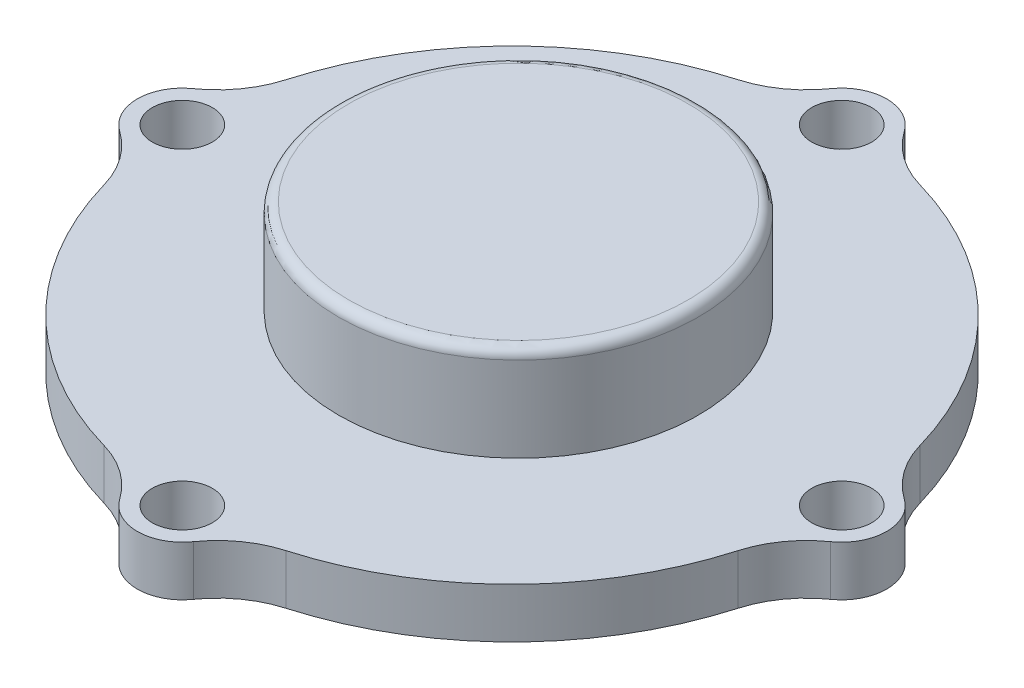
ISO-10303-21;
HEADER;
FILE_DESCRIPTION(('STEP AP214'),'2;1');
FILE_NAME('part.step','',(''),(''),'','','');
FILE_SCHEMA(('AUTOMOTIVE_DESIGN { 1 0 10303 214 1 1 1 1 }'));
ENDSEC;
DATA;
#1=APPLICATION_CONTEXT('core data for automotive mechanical design processes');
#2=APPLICATION_PROTOCOL_DEFINITION('international standard','automotive_design',2000,#1);
#3=PRODUCT_CONTEXT('',#1,'mechanical');
#4=PRODUCT('Part','Part','',(#3));
#5=PRODUCT_RELATED_PRODUCT_CATEGORY('part','',(#4));
#6=PRODUCT_DEFINITION_FORMATION('','',#4);
#7=PRODUCT_DEFINITION_CONTEXT('part definition',#1,'design');
#8=PRODUCT_DEFINITION('design','',#6,#7);
#9=PRODUCT_DEFINITION_SHAPE('','',#8);
#10=(LENGTH_UNIT() NAMED_UNIT(*) SI_UNIT(.MILLI.,.METRE.));
#11=(NAMED_UNIT(*) PLANE_ANGLE_UNIT() SI_UNIT($,.RADIAN.));
#12=(NAMED_UNIT(*) SI_UNIT($,.STERADIAN.) SOLID_ANGLE_UNIT());
#13=UNCERTAINTY_MEASURE_WITH_UNIT(LENGTH_MEASURE(1.E-05),#10,'distance_accuracy_value','');
#14=(GEOMETRIC_REPRESENTATION_CONTEXT(3) GLOBAL_UNCERTAINTY_ASSIGNED_CONTEXT((#13)) GLOBAL_UNIT_ASSIGNED_CONTEXT((#10,
#11,#12)) REPRESENTATION_CONTEXT('',''));
#15=CARTESIAN_POINT('',(0.,0.,0.));
#16=DIRECTION('',(0.,0.,1.));
#17=DIRECTION('',(1.,0.,0.));
#18=AXIS2_PLACEMENT_3D('',#15,#16,#17);
#19=CARTESIAN_POINT('',(0.,5.,0.));
#20=DIRECTION('',(0.,1.,0.));
#21=DIRECTION('',(0.,0.,1.));
#22=AXIS2_PLACEMENT_3D('',#19,#20,#21);
#23=PLANE('',#22);
#24=CARTESIAN_POINT('',(0.,5.,-0.64740108925233));
#25=DIRECTION('',(0.,1.,0.));
#26=DIRECTION('',(0.,0.,1.));
#27=AXIS2_PLACEMENT_3D('',#24,#25,#26);
#28=CIRCLE('',#27,18.);
#29=CARTESIAN_POINT('',(0.,5.,17.3525989107477));
#30=VERTEX_POINT('',#29);
#31=EDGE_CURVE('E242',#30,#30,#28,.T.);
#32=ORIENTED_EDGE('',*,*,#31,.F.);
#33=EDGE_LOOP('',(#32));
#34=FACE_BOUND('',#33,.T.);
#35=CARTESIAN_POINT('',(0.00100000000000606,5.,33.001));
#36=DIRECTION('',(0.,1.,0.));
#37=DIRECTION('',(0.,0.,1.));
#38=AXIS2_PLACEMENT_3D('',#35,#36,#37);
#39=CIRCLE('',#38,3.);
#40=CARTESIAN_POINT('',(0.00100000000000606,5.,36.001));
#41=VERTEX_POINT('',#40);
#42=EDGE_CURVE('E201',#41,#41,#39,.T.);
#43=ORIENTED_EDGE('',*,*,#42,.F.);
#44=EDGE_LOOP('',(#43));
#45=FACE_BOUND('',#44,.T.);
#46=CARTESIAN_POINT('',(33.002,5.,0.));
#47=DIRECTION('',(0.,1.,0.));
#48=DIRECTION('',(0.,0.,1.));
#49=AXIS2_PLACEMENT_3D('',#46,#47,#48);
#50=CIRCLE('',#49,3.);
#51=CARTESIAN_POINT('',(33.002,5.,3.));
#52=VERTEX_POINT('',#51);
#53=EDGE_CURVE('E184',#52,#52,#50,.T.);
#54=ORIENTED_EDGE('',*,*,#53,.F.);
#55=EDGE_LOOP('',(#54));
#56=FACE_BOUND('',#55,.T.);
#57=CARTESIAN_POINT('',(0.000999999999997979,5.,-33.001));
#58=DIRECTION('',(0.,1.,0.));
#59=DIRECTION('',(0.,0.,1.));
#60=AXIS2_PLACEMENT_3D('',#57,#58,#59);
#61=CIRCLE('',#60,3.);
#62=CARTESIAN_POINT('',(0.000999999999997979,5.,-30.001));
#63=VERTEX_POINT('',#62);
#64=EDGE_CURVE('E212',#63,#63,#61,.T.);
#65=ORIENTED_EDGE('',*,*,#64,.F.);
#66=EDGE_LOOP('',(#65));
#67=FACE_BOUND('',#66,.T.);
#68=CARTESIAN_POINT('',(-33.,5.,0.));
#69=DIRECTION('',(0.,1.,0.));
#70=DIRECTION('',(0.,0.,1.));
#71=AXIS2_PLACEMENT_3D('',#68,#69,#70);
#72=CIRCLE('',#71,3.);
#73=CARTESIAN_POINT('',(-33.,5.,3.));
#74=VERTEX_POINT('',#73);
#75=EDGE_CURVE('E194',#74,#74,#72,.T.);
#76=ORIENTED_EDGE('',*,*,#75,.F.);
#77=EDGE_LOOP('',(#76));
#78=FACE_BOUND('',#77,.T.);
#79=CARTESIAN_POINT('',(0.,5.,0.));
#80=DIRECTION('',(0.,-1.,0.));
#81=DIRECTION('',(0.,0.,-1.));
#82=AXIS2_PLACEMENT_3D('',#79,#80,#81);
#83=CIRCLE('',#82,33.);
#84=CARTESIAN_POINT('',(-9.10862232961965,5.,31.718023255814));
#85=VERTEX_POINT('',#84);
#86=CARTESIAN_POINT('',(-31.7180232558139,5.,9.10862232961966));
#87=VERTEX_POINT('',#86);
#88=EDGE_CURVE('E255',#85,#87,#83,.T.);
#89=ORIENTED_EDGE('',*,*,#88,.F.);
#90=CARTESIAN_POINT('',(-11.8688109143529,5.,41.3295454545454));
#91=DIRECTION('',(0.,1.,0.));
#92=DIRECTION('',(0.,0.,1.));
#93=AXIS2_PLACEMENT_3D('',#90,#91,#92);
#94=CIRCLE('',#93,10.);
#95=CARTESIAN_POINT('',(-3.68342407686815,5.,35.5850313479624));
#96=VERTEX_POINT('',#95);
#97=EDGE_CURVE('E50',#96,#85,#94,.T.);
#98=ORIENTED_EDGE('',*,*,#97,.F.);
#99=CARTESIAN_POINT('',(0.,5.,33.));
#100=DIRECTION('',(0.,-1.,0.));
#101=DIRECTION('',(0.,0.,-1.));
#102=AXIS2_PLACEMENT_3D('',#99,#100,#101);
#103=CIRCLE('',#102,4.50000000000003);
#104=CARTESIAN_POINT('',(3.68342407686815,5.,35.5850313479624));
#105=VERTEX_POINT('',#104);
#106=EDGE_CURVE('E295',#105,#96,#103,.T.);
#107=ORIENTED_EDGE('',*,*,#106,.F.);
#108=CARTESIAN_POINT('',(11.8688109143529,5.,41.3295454545454));
#109=DIRECTION('',(0.,1.,0.));
#110=DIRECTION('',(0.,0.,-1.));
#111=AXIS2_PLACEMENT_3D('',#108,#109,#110);
#112=CIRCLE('',#111,10.);
#113=CARTESIAN_POINT('',(9.10862232961966,5.,31.7180232558139));
#114=VERTEX_POINT('',#113);
#115=EDGE_CURVE('E292',#114,#105,#112,.T.);
#116=ORIENTED_EDGE('',*,*,#115,.F.);
#117=CARTESIAN_POINT('',(0.,5.,0.));
#118=DIRECTION('',(0.,-1.,0.));
#119=DIRECTION('',(0.,0.,-1.));
#120=AXIS2_PLACEMENT_3D('',#117,#118,#119);
#121=CIRCLE('',#120,33.);
#122=CARTESIAN_POINT('',(31.718023255814,5.,9.1086223296196));
#123=VERTEX_POINT('',#122);
#124=EDGE_CURVE('E289',#123,#114,#121,.T.);
#125=ORIENTED_EDGE('',*,*,#124,.F.);
#126=CARTESIAN_POINT('',(41.3295454545455,5.,11.8688109143528));
#127=DIRECTION('',(0.,1.,0.));
#128=DIRECTION('',(0.,0.,1.));
#129=AXIS2_PLACEMENT_3D('',#126,#127,#128);
#130=CIRCLE('',#129,10.);
#131=CARTESIAN_POINT('',(35.5850313479624,5.,3.6834240768681));
#132=VERTEX_POINT('',#131);
#133=EDGE_CURVE('E286',#132,#123,#130,.T.);
#134=ORIENTED_EDGE('',*,*,#133,.F.);
#135=CARTESIAN_POINT('',(33.,5.,0.));
#136=DIRECTION('',(0.,-1.,0.));
#137=DIRECTION('',(0.,0.,-1.));
#138=AXIS2_PLACEMENT_3D('',#135,#136,#137);
#139=CIRCLE('',#138,4.49999999999998);
#140=CARTESIAN_POINT('',(35.5850313479624,5.,-3.6834240768681));
#141=VERTEX_POINT('',#140);
#142=EDGE_CURVE('E284',#141,#132,#139,.T.);
#143=ORIENTED_EDGE('',*,*,#142,.F.);
#144=CARTESIAN_POINT('',(41.3295454545455,5.,-11.8688109143528));
#145=DIRECTION('',(0.,1.,0.));
#146=DIRECTION('',(0.,0.,-1.));
#147=AXIS2_PLACEMENT_3D('',#144,#145,#146);
#148=CIRCLE('',#147,10.);
#149=CARTESIAN_POINT('',(31.718023255814,5.,-9.1086223296196));
#150=VERTEX_POINT('',#149);
#151=EDGE_CURVE('E281',#150,#141,#148,.T.);
#152=ORIENTED_EDGE('',*,*,#151,.F.);
#153=CARTESIAN_POINT('',(0.,5.,0.));
#154=DIRECTION('',(0.,-1.,0.));
#155=DIRECTION('',(0.,0.,-1.));
#156=AXIS2_PLACEMENT_3D('',#153,#154,#155);
#157=CIRCLE('',#156,33.);
#158=CARTESIAN_POINT('',(9.1086223296196,5.,-31.718023255814));
#159=VERTEX_POINT('',#158);
#160=EDGE_CURVE('E278',#159,#150,#157,.T.);
#161=ORIENTED_EDGE('',*,*,#160,.F.);
#162=CARTESIAN_POINT('',(11.8688109143528,5.,-41.3295454545455));
#163=DIRECTION('',(0.,1.,0.));
#164=DIRECTION('',(0.,0.,1.));
#165=AXIS2_PLACEMENT_3D('',#162,#163,#164);
#166=CIRCLE('',#165,10.);
#167=CARTESIAN_POINT('',(3.6834240768681,5.,-35.5850313479624));
#168=VERTEX_POINT('',#167);
#169=EDGE_CURVE('E275',#168,#159,#166,.T.);
#170=ORIENTED_EDGE('',*,*,#169,.F.);
#171=CARTESIAN_POINT('',(0.,5.,-33.));
#172=DIRECTION('',(0.,-1.,0.));
#173=DIRECTION('',(0.,0.,-1.));
#174=AXIS2_PLACEMENT_3D('',#171,#172,#173);
#175=CIRCLE('',#174,4.49999999999998);
#176=CARTESIAN_POINT('',(-3.6834240768681,5.,-35.5850313479624));
#177=VERTEX_POINT('',#176);
#178=EDGE_CURVE('E273',#177,#168,#175,.T.);
#179=ORIENTED_EDGE('',*,*,#178,.F.);
#180=CARTESIAN_POINT('',(-11.8688109143528,5.,-41.3295454545455));
#181=DIRECTION('',(0.,1.,0.));
#182=DIRECTION('',(0.,0.,-1.));
#183=AXIS2_PLACEMENT_3D('',#180,#181,#182);
#184=CIRCLE('',#183,10.);
#185=CARTESIAN_POINT('',(-9.1086223296196,5.,-31.718023255814));
#186=VERTEX_POINT('',#185);
#187=EDGE_CURVE('E270',#186,#177,#184,.T.);
#188=ORIENTED_EDGE('',*,*,#187,.F.);
#189=CARTESIAN_POINT('',(0.,5.,0.));
#190=DIRECTION('',(0.,-1.,0.));
#191=DIRECTION('',(0.,0.,-1.));
#192=AXIS2_PLACEMENT_3D('',#189,#190,#191);
#193=CIRCLE('',#192,33.);
#194=CARTESIAN_POINT('',(-31.718023255814,5.,-9.10862232961965));
#195=VERTEX_POINT('',#194);
#196=EDGE_CURVE('E267',#195,#186,#193,.T.);
#197=ORIENTED_EDGE('',*,*,#196,.F.);
#198=CARTESIAN_POINT('',(-41.3295454545454,5.,-11.8688109143529));
#199=DIRECTION('',(0.,1.,0.));
#200=DIRECTION('',(0.,0.,1.));
#201=AXIS2_PLACEMENT_3D('',#198,#199,#200);
#202=CIRCLE('',#201,10.);
#203=CARTESIAN_POINT('',(-35.5850313479624,5.,-3.68342407686815));
#204=VERTEX_POINT('',#203);
#205=EDGE_CURVE('E264',#204,#195,#202,.T.);
#206=ORIENTED_EDGE('',*,*,#205,.F.);
#207=CARTESIAN_POINT('',(-33.,5.,0.));
#208=DIRECTION('',(0.,-1.,0.));
#209=DIRECTION('',(0.,0.,-1.));
#210=AXIS2_PLACEMENT_3D('',#207,#208,#209);
#211=CIRCLE('',#210,4.50000000000003);
#212=CARTESIAN_POINT('',(-35.5850313479624,5.,3.68342407686816));
#213=VERTEX_POINT('',#212);
#214=EDGE_CURVE('E262',#213,#204,#211,.T.);
#215=ORIENTED_EDGE('',*,*,#214,.F.);
#216=CARTESIAN_POINT('',(-41.3295454545454,5.,11.8688109143529));
#217=DIRECTION('',(0.,1.,0.));
#218=DIRECTION('',(0.,0.,-1.));
#219=AXIS2_PLACEMENT_3D('',#216,#217,#218);
#220=CIRCLE('',#219,10.);
#221=EDGE_CURVE('E259',#87,#213,#220,.T.);
#222=ORIENTED_EDGE('',*,*,#221,.F.);
#223=EDGE_LOOP('',(#89,#98,#107,#116,#125,#134,#143,#152,#161,#170,#179,#188,#197,#206,#215,#222));
#224=FACE_BOUND('',#223,.T.);
#225=ADVANCED_FACE('F35',(#34,#45,#56,#67,#78,#224),#23,.T.);
#226=CARTESIAN_POINT('',(0.,0.,0.));
#227=DIRECTION('',(0.,1.,0.));
#228=DIRECTION('',(0.,0.,1.));
#229=AXIS2_PLACEMENT_3D('',#226,#227,#228);
#230=PLANE('',#229);
#231=CARTESIAN_POINT('',(0.,0.,0.));
#232=DIRECTION('',(0.,-1.,0.));
#233=DIRECTION('',(0.,0.,-1.));
#234=AXIS2_PLACEMENT_3D('',#231,#232,#233);
#235=CIRCLE('',#234,27.75);
#236=CARTESIAN_POINT('',(0.,0.,-27.75));
#237=VERTEX_POINT('',#236);
#238=EDGE_CURVE('E334',#237,#237,#235,.T.);
#239=ORIENTED_EDGE('',*,*,#238,.F.);
#240=EDGE_LOOP('',(#239));
#241=FACE_BOUND('',#240,.T.);
#242=CARTESIAN_POINT('',(0.00100000000000606,0.,33.001));
#243=DIRECTION('',(0.,1.,0.));
#244=DIRECTION('',(0.,0.,1.));
#245=AXIS2_PLACEMENT_3D('',#242,#243,#244);
#246=CIRCLE('',#245,3.);
#247=CARTESIAN_POINT('',(0.00100000000000606,0.,36.001));
#248=VERTEX_POINT('',#247);
#249=EDGE_CURVE('E217',#248,#248,#246,.T.);
#250=ORIENTED_EDGE('',*,*,#249,.T.);
#251=EDGE_LOOP('',(#250));
#252=FACE_BOUND('',#251,.T.);
#253=CARTESIAN_POINT('',(33.002,0.,0.));
#254=DIRECTION('',(0.,1.,0.));
#255=DIRECTION('',(0.,0.,1.));
#256=AXIS2_PLACEMENT_3D('',#253,#254,#255);
#257=CIRCLE('',#256,3.);
#258=CARTESIAN_POINT('',(33.002,0.,3.));
#259=VERTEX_POINT('',#258);
#260=EDGE_CURVE('E220',#259,#259,#257,.T.);
#261=ORIENTED_EDGE('',*,*,#260,.T.);
#262=EDGE_LOOP('',(#261));
#263=FACE_BOUND('',#262,.T.);
#264=CARTESIAN_POINT('',(0.000999999999997979,0.,-33.001));
#265=DIRECTION('',(0.,1.,0.));
#266=DIRECTION('',(0.,0.,1.));
#267=AXIS2_PLACEMENT_3D('',#264,#265,#266);
#268=CIRCLE('',#267,3.);
#269=CARTESIAN_POINT('',(0.000999999999997979,0.,-30.001));
#270=VERTEX_POINT('',#269);
#271=EDGE_CURVE('E224',#270,#270,#268,.T.);
#272=ORIENTED_EDGE('',*,*,#271,.T.);
#273=EDGE_LOOP('',(#272));
#274=FACE_BOUND('',#273,.T.);
#275=CARTESIAN_POINT('',(-33.,0.,0.));
#276=DIRECTION('',(0.,1.,0.));
#277=DIRECTION('',(0.,0.,1.));
#278=AXIS2_PLACEMENT_3D('',#275,#276,#277);
#279=CIRCLE('',#278,3.);
#280=CARTESIAN_POINT('',(-33.,0.,3.));
#281=VERTEX_POINT('',#280);
#282=EDGE_CURVE('E205',#281,#281,#279,.T.);
#283=ORIENTED_EDGE('',*,*,#282,.T.);
#284=EDGE_LOOP('',(#283));
#285=FACE_BOUND('',#284,.T.);
#286=CARTESIAN_POINT('',(-11.8688109143529,0.,41.3295454545454));
#287=DIRECTION('',(0.,1.,0.));
#288=DIRECTION('',(0.,0.,1.));
#289=AXIS2_PLACEMENT_3D('',#286,#287,#288);
#290=CIRCLE('',#289,10.);
#291=CARTESIAN_POINT('',(-3.68342407686815,0.,35.5850313479624));
#292=VERTEX_POINT('',#291);
#293=CARTESIAN_POINT('',(-9.10862232961965,0.,31.718023255814));
#294=VERTEX_POINT('',#293);
#295=EDGE_CURVE('E298',#292,#294,#290,.T.);
#296=ORIENTED_EDGE('',*,*,#295,.T.);
#297=CARTESIAN_POINT('',(0.,0.,0.));
#298=DIRECTION('',(0.,-1.,0.));
#299=DIRECTION('',(0.,0.,-1.));
#300=AXIS2_PLACEMENT_3D('',#297,#298,#299);
#301=CIRCLE('',#300,33.);
#302=CARTESIAN_POINT('',(-31.7180232558139,0.,9.10862232961966));
#303=VERTEX_POINT('',#302);
#304=EDGE_CURVE('E301',#294,#303,#301,.T.);
#305=ORIENTED_EDGE('',*,*,#304,.T.);
#306=CARTESIAN_POINT('',(-41.3295454545454,0.,11.8688109143529));
#307=DIRECTION('',(0.,1.,0.));
#308=DIRECTION('',(0.,0.,-1.));
#309=AXIS2_PLACEMENT_3D('',#306,#307,#308);
#310=CIRCLE('',#309,10.);
#311=CARTESIAN_POINT('',(-35.5850313479624,0.,3.68342407686816));
#312=VERTEX_POINT('',#311);
#313=EDGE_CURVE('E58',#303,#312,#310,.T.);
#314=ORIENTED_EDGE('',*,*,#313,.T.);
#315=CARTESIAN_POINT('',(-33.,0.,0.));
#316=DIRECTION('',(0.,1.,0.));
#317=DIRECTION('',(0.,0.,1.));
#318=AXIS2_PLACEMENT_3D('',#315,#316,#317);
#319=CIRCLE('',#318,4.50000000000003);
#320=CARTESIAN_POINT('',(-35.5850313479624,0.,-3.68342407686815));
#321=VERTEX_POINT('',#320);
#322=EDGE_CURVE('E235',#321,#312,#319,.T.);
#323=ORIENTED_EDGE('',*,*,#322,.F.);
#324=CARTESIAN_POINT('',(-41.3295454545454,0.,-11.8688109143529));
#325=DIRECTION('',(0.,1.,0.));
#326=DIRECTION('',(0.,0.,1.));
#327=AXIS2_PLACEMENT_3D('',#324,#325,#326);
#328=CIRCLE('',#327,10.);
#329=CARTESIAN_POINT('',(-31.718023255814,0.,-9.10862232961965));
#330=VERTEX_POINT('',#329);
#331=EDGE_CURVE('E306',#321,#330,#328,.T.);
#332=ORIENTED_EDGE('',*,*,#331,.T.);
#333=CARTESIAN_POINT('',(0.,0.,0.));
#334=DIRECTION('',(0.,-1.,0.));
#335=DIRECTION('',(0.,0.,-1.));
#336=AXIS2_PLACEMENT_3D('',#333,#334,#335);
#337=CIRCLE('',#336,33.);
#338=CARTESIAN_POINT('',(-9.1086223296196,0.,-31.718023255814));
#339=VERTEX_POINT('',#338);
#340=EDGE_CURVE('E309',#330,#339,#337,.T.);
#341=ORIENTED_EDGE('',*,*,#340,.T.);
#342=CARTESIAN_POINT('',(-11.8688109143528,0.,-41.3295454545455));
#343=DIRECTION('',(0.,1.,0.));
#344=DIRECTION('',(0.,0.,-1.));
#345=AXIS2_PLACEMENT_3D('',#342,#343,#344);
#346=CIRCLE('',#345,10.);
#347=CARTESIAN_POINT('',(-3.6834240768681,0.,-35.5850313479624));
#348=VERTEX_POINT('',#347);
#349=EDGE_CURVE('E312',#339,#348,#346,.T.);
#350=ORIENTED_EDGE('',*,*,#349,.T.);
#351=CARTESIAN_POINT('',(0.,0.,-33.));
#352=DIRECTION('',(0.,1.,0.));
#353=DIRECTION('',(0.,0.,1.));
#354=AXIS2_PLACEMENT_3D('',#351,#352,#353);
#355=CIRCLE('',#354,4.49999999999998);
#356=CARTESIAN_POINT('',(3.6834240768681,0.,-35.5850313479624));
#357=VERTEX_POINT('',#356);
#358=EDGE_CURVE('E237',#357,#348,#355,.T.);
#359=ORIENTED_EDGE('',*,*,#358,.F.);
#360=CARTESIAN_POINT('',(11.8688109143528,0.,-41.3295454545455));
#361=DIRECTION('',(0.,1.,0.));
#362=DIRECTION('',(0.,0.,1.));
#363=AXIS2_PLACEMENT_3D('',#360,#361,#362);
#364=CIRCLE('',#363,10.);
#365=CARTESIAN_POINT('',(9.1086223296196,0.,-31.718023255814));
#366=VERTEX_POINT('',#365);
#367=EDGE_CURVE('E315',#357,#366,#364,.T.);
#368=ORIENTED_EDGE('',*,*,#367,.T.);
#369=CARTESIAN_POINT('',(0.,0.,0.));
#370=DIRECTION('',(0.,-1.,0.));
#371=DIRECTION('',(0.,0.,-1.));
#372=AXIS2_PLACEMENT_3D('',#369,#370,#371);
#373=CIRCLE('',#372,33.);
#374=CARTESIAN_POINT('',(31.718023255814,0.,-9.1086223296196));
#375=VERTEX_POINT('',#374);
#376=EDGE_CURVE('E318',#366,#375,#373,.T.);
#377=ORIENTED_EDGE('',*,*,#376,.T.);
#378=CARTESIAN_POINT('',(41.3295454545455,0.,-11.8688109143528));
#379=DIRECTION('',(0.,1.,0.));
#380=DIRECTION('',(0.,0.,-1.));
#381=AXIS2_PLACEMENT_3D('',#378,#379,#380);
#382=CIRCLE('',#381,10.);
#383=CARTESIAN_POINT('',(35.5850313479624,0.,-3.6834240768681));
#384=VERTEX_POINT('',#383);
#385=EDGE_CURVE('E321',#375,#384,#382,.T.);
#386=ORIENTED_EDGE('',*,*,#385,.T.);
#387=CARTESIAN_POINT('',(33.,0.,0.));
#388=DIRECTION('',(0.,1.,0.));
#389=DIRECTION('',(0.,0.,1.));
#390=AXIS2_PLACEMENT_3D('',#387,#388,#389);
#391=CIRCLE('',#390,4.49999999999998);
#392=CARTESIAN_POINT('',(35.5850313479624,0.,3.6834240768681));
#393=VERTEX_POINT('',#392);
#394=EDGE_CURVE('E239',#393,#384,#391,.T.);
#395=ORIENTED_EDGE('',*,*,#394,.F.);
#396=CARTESIAN_POINT('',(41.3295454545455,0.,11.8688109143528));
#397=DIRECTION('',(0.,1.,0.));
#398=DIRECTION('',(0.,0.,1.));
#399=AXIS2_PLACEMENT_3D('',#396,#397,#398);
#400=CIRCLE('',#399,10.);
#401=CARTESIAN_POINT('',(31.718023255814,0.,9.1086223296196));
#402=VERTEX_POINT('',#401);
#403=EDGE_CURVE('E324',#393,#402,#400,.T.);
#404=ORIENTED_EDGE('',*,*,#403,.T.);
#405=CARTESIAN_POINT('',(0.,0.,0.));
#406=DIRECTION('',(0.,-1.,0.));
#407=DIRECTION('',(0.,0.,-1.));
#408=AXIS2_PLACEMENT_3D('',#405,#406,#407);
#409=CIRCLE('',#408,33.);
#410=CARTESIAN_POINT('',(9.10862232961966,0.,31.7180232558139));
#411=VERTEX_POINT('',#410);
#412=EDGE_CURVE('E327',#402,#411,#409,.T.);
#413=ORIENTED_EDGE('',*,*,#412,.T.);
#414=CARTESIAN_POINT('',(11.8688109143529,0.,41.3295454545454));
#415=DIRECTION('',(0.,1.,0.));
#416=DIRECTION('',(0.,0.,-1.));
#417=AXIS2_PLACEMENT_3D('',#414,#415,#416);
#418=CIRCLE('',#417,10.);
#419=CARTESIAN_POINT('',(3.68342407686815,0.,35.5850313479624));
#420=VERTEX_POINT('',#419);
#421=EDGE_CURVE('E256',#411,#420,#418,.T.);
#422=ORIENTED_EDGE('',*,*,#421,.T.);
#423=CARTESIAN_POINT('',(0.,0.,33.));
#424=DIRECTION('',(0.,1.,0.));
#425=DIRECTION('',(0.,0.,1.));
#426=AXIS2_PLACEMENT_3D('',#423,#424,#425);
#427=CIRCLE('',#426,4.50000000000003);
#428=EDGE_CURVE('E241',#292,#420,#427,.T.);
#429=ORIENTED_EDGE('',*,*,#428,.F.);
#430=EDGE_LOOP('',(#296,#305,#314,#323,#332,#341,#350,#359,#368,#377,#386,#395,#404,#413,#422,#429));
#431=FACE_BOUND('',#430,.T.);
#432=ADVANCED_FACE('F397',(#241,#252,#263,#274,#285,#431),#230,.F.);
#433=CARTESIAN_POINT('',(0.00099999999999999,5.,0.00100000000000694));
#434=DIRECTION('',(0.,-1.,0.));
#435=DIRECTION('',(0.,0.,-1.));
#436=AXIS2_PLACEMENT_3D('',#433,#434,#435);
#437=CYLINDRICAL_SURFACE('',#436,12.5);
#438=DIRECTION('',(0.,-1.,0.));
#439=VECTOR('',#438,1.);
#440=CARTESIAN_POINT('',(8.84033475068964,5.,8.83933475068979));
#441=LINE('',#440,#439);
#442=CARTESIAN_POINT('',(8.84033475068964,5.,8.83933475068979));
#443=VERTEX_POINT('',#442);
#444=CARTESIAN_POINT('',(8.84033475068964,3.,8.83933475068979));
#445=VERTEX_POINT('',#444);
#446=EDGE_CURVE('E188',#443,#445,#441,.T.);
#447=ORIENTED_EDGE('',*,*,#446,.T.);
#448=CARTESIAN_POINT('',(0.00099999999999999,3.,0.00100000000000694));
#449=DIRECTION('',(0.,-1.,0.));
#450=DIRECTION('',(0.,0.,-1.));
#451=AXIS2_PLACEMENT_3D('',#448,#449,#450);
#452=CIRCLE('',#451,12.5);
#453=CARTESIAN_POINT('',(-8.83833475068976,3.,8.83933475068967));
#454=VERTEX_POINT('',#453);
#455=EDGE_CURVE('E221',#445,#454,#452,.T.);
#456=ORIENTED_EDGE('',*,*,#455,.T.);
#457=DIRECTION('',(0.,-1.,0.));
#458=VECTOR('',#457,1.);
#459=CARTESIAN_POINT('',(-8.83833475068976,5.,8.83933475068967));
#460=LINE('',#459,#458);
#461=CARTESIAN_POINT('',(-8.83833475068976,5.,8.83933475068967));
#462=VERTEX_POINT('',#461);
#463=EDGE_CURVE('E198',#462,#454,#460,.T.);
#464=ORIENTED_EDGE('',*,*,#463,.F.);
#465=CARTESIAN_POINT('',(0.00099999999999999,5.,0.00100000000000694));
#466=DIRECTION('',(0.,1.,0.));
#467=DIRECTION('',(0.,0.,1.));
#468=AXIS2_PLACEMENT_3D('',#465,#466,#467);
#469=CIRCLE('',#468,12.5);
#470=EDGE_CURVE('E177',#462,#443,#469,.T.);
#471=ORIENTED_EDGE('',*,*,#470,.T.);
#472=EDGE_LOOP('',(#447,#456,#464,#471));
#473=FACE_BOUND('',#472,.T.);
#474=ADVANCED_FACE('F196',(#473),#437,.F.);
#475=CARTESIAN_POINT('',(0.,5.,0.));
#476=DIRECTION('',(0.,-1.,0.));
#477=DIRECTION('',(0.,0.,-1.));
#478=AXIS2_PLACEMENT_3D('',#475,#476,#477);
#479=CYLINDRICAL_SURFACE('',#478,12.5);
#480=ORIENTED_EDGE('',*,*,#463,.T.);
#481=CARTESIAN_POINT('',(0.,3.,0.));
#482=DIRECTION('',(0.,-1.,0.));
#483=DIRECTION('',(0.,0.,-1.));
#484=AXIS2_PLACEMENT_3D('',#481,#482,#483);
#485=CIRCLE('',#484,12.5);
#486=CARTESIAN_POINT('',(-8.8383347506897,3.,-8.83933475068973));
#487=VERTEX_POINT('',#486);
#488=EDGE_CURVE('E375',#454,#487,#485,.T.);
#489=ORIENTED_EDGE('',*,*,#488,.T.);
#490=DIRECTION('',(0.,-1.,0.));
#491=VECTOR('',#490,1.);
#492=CARTESIAN_POINT('',(-8.8383347506897,5.,-8.83933475068973));
#493=LINE('',#492,#491);
#494=CARTESIAN_POINT('',(-8.8383347506897,5.,-8.83933475068973));
#495=VERTEX_POINT('',#494);
#496=EDGE_CURVE('E230',#495,#487,#493,.T.);
#497=ORIENTED_EDGE('',*,*,#496,.F.);
#498=CARTESIAN_POINT('',(0.,5.,0.));
#499=DIRECTION('',(0.,1.,0.));
#500=DIRECTION('',(0.,0.,1.));
#501=AXIS2_PLACEMENT_3D('',#498,#499,#500);
#502=CIRCLE('',#501,12.5);
#503=EDGE_CURVE('E200',#495,#462,#502,.T.);
#504=ORIENTED_EDGE('',*,*,#503,.T.);
#505=EDGE_LOOP('',(#480,#489,#497,#504));
#506=FACE_BOUND('',#505,.T.);
#507=ADVANCED_FACE('F379',(#506),#479,.F.);
#508=CARTESIAN_POINT('',(0.001,5.,-0.00100000000000694));
#509=DIRECTION('',(0.,-1.,0.));
#510=DIRECTION('',(0.,0.,-1.));
#511=AXIS2_PLACEMENT_3D('',#508,#509,#510);
#512=CYLINDRICAL_SURFACE('',#511,12.5);
#513=ORIENTED_EDGE('',*,*,#496,.T.);
#514=CARTESIAN_POINT('',(0.001,3.,-0.00100000000000694));
#515=DIRECTION('',(0.,-1.,0.));
#516=DIRECTION('',(0.,0.,-1.));
#517=AXIS2_PLACEMENT_3D('',#514,#515,#516);
#518=CIRCLE('',#517,12.5);
#519=CARTESIAN_POINT('',(8.84033475068976,3.,-8.83933475068967));
#520=VERTEX_POINT('',#519);
#521=EDGE_CURVE('E370',#487,#520,#518,.T.);
#522=ORIENTED_EDGE('',*,*,#521,.T.);
#523=DIRECTION('',(0.,-1.,0.));
#524=VECTOR('',#523,1.);
#525=CARTESIAN_POINT('',(8.84033475068976,5.,-8.83933475068966));
#526=LINE('',#525,#524);
#527=CARTESIAN_POINT('',(8.84033475068976,5.,-8.83933475068966));
#528=VERTEX_POINT('',#527);
#529=EDGE_CURVE('E193',#528,#520,#526,.T.);
#530=ORIENTED_EDGE('',*,*,#529,.F.);
#531=CARTESIAN_POINT('',(0.001,5.,-0.00100000000000694));
#532=DIRECTION('',(0.,1.,0.));
#533=DIRECTION('',(0.,0.,1.));
#534=AXIS2_PLACEMENT_3D('',#531,#532,#533);
#535=CIRCLE('',#534,12.5);
#536=EDGE_CURVE('E180',#528,#495,#535,.T.);
#537=ORIENTED_EDGE('',*,*,#536,.T.);
#538=EDGE_LOOP('',(#513,#522,#530,#537));
#539=FACE_BOUND('',#538,.T.);
#540=ADVANCED_FACE('F382',(#539),#512,.F.);
#541=CARTESIAN_POINT('',(0.00200000000000694,5.,0.));
#542=DIRECTION('',(0.,-1.,0.));
#543=DIRECTION('',(0.,0.,-1.));
#544=AXIS2_PLACEMENT_3D('',#541,#542,#543);
#545=CYLINDRICAL_SURFACE('',#544,12.5);
#546=ORIENTED_EDGE('',*,*,#529,.T.);
#547=CARTESIAN_POINT('',(0.00200000000000694,3.,0.));
#548=DIRECTION('',(0.,-1.,0.));
#549=DIRECTION('',(0.,0.,-1.));
#550=AXIS2_PLACEMENT_3D('',#547,#548,#549);
#551=CIRCLE('',#550,12.5);
#552=EDGE_CURVE('E190',#520,#445,#551,.T.);
#553=ORIENTED_EDGE('',*,*,#552,.T.);
#554=ORIENTED_EDGE('',*,*,#446,.F.);
#555=CARTESIAN_POINT('',(0.00200000000000694,5.,0.));
#556=DIRECTION('',(0.,1.,0.));
#557=DIRECTION('',(0.,0.,1.));
#558=AXIS2_PLACEMENT_3D('',#555,#556,#557);
#559=CIRCLE('',#558,12.5);
#560=EDGE_CURVE('E173',#443,#528,#559,.T.);
#561=ORIENTED_EDGE('',*,*,#560,.T.);
#562=EDGE_LOOP('',(#546,#553,#554,#561));
#563=FACE_BOUND('',#562,.T.);
#564=ADVANCED_FACE('F189',(#563),#545,.F.);
#565=CARTESIAN_POINT('',(-33.,5.,0.));
#566=DIRECTION('',(0.,-1.,0.));
#567=DIRECTION('',(0.,0.,-1.));
#568=AXIS2_PLACEMENT_3D('',#565,#566,#567);
#569=CYLINDRICAL_SURFACE('',#568,3.);
#570=ORIENTED_EDGE('',*,*,#75,.T.);
#571=EDGE_LOOP('',(#570));
#572=FACE_BOUND('',#571,.T.);
#573=ORIENTED_EDGE('',*,*,#282,.F.);
#574=EDGE_LOOP('',(#573));
#575=FACE_BOUND('',#574,.T.);
#576=ADVANCED_FACE('F487',(#572,#575),#569,.F.);
#577=CARTESIAN_POINT('',(0.000999999999997979,5.,-33.001));
#578=DIRECTION('',(0.,-1.,0.));
#579=DIRECTION('',(0.,0.,-1.));
#580=AXIS2_PLACEMENT_3D('',#577,#578,#579);
#581=CYLINDRICAL_SURFACE('',#580,3.);
#582=ORIENTED_EDGE('',*,*,#64,.T.);
#583=EDGE_LOOP('',(#582));
#584=FACE_BOUND('',#583,.T.);
#585=ORIENTED_EDGE('',*,*,#271,.F.);
#586=EDGE_LOOP('',(#585));
#587=FACE_BOUND('',#586,.T.);
#588=ADVANCED_FACE('F490',(#584,#587),#581,.F.);
#589=CARTESIAN_POINT('',(33.002,5.,0.));
#590=DIRECTION('',(0.,-1.,0.));
#591=DIRECTION('',(0.,0.,-1.));
#592=AXIS2_PLACEMENT_3D('',#589,#590,#591);
#593=CYLINDRICAL_SURFACE('',#592,3.);
#594=ORIENTED_EDGE('',*,*,#53,.T.);
#595=EDGE_LOOP('',(#594));
#596=FACE_BOUND('',#595,.T.);
#597=ORIENTED_EDGE('',*,*,#260,.F.);
#598=EDGE_LOOP('',(#597));
#599=FACE_BOUND('',#598,.T.);
#600=ADVANCED_FACE('F494',(#596,#599),#593,.F.);
#601=CARTESIAN_POINT('',(0.00100000000000606,5.,33.001));
#602=DIRECTION('',(0.,-1.,0.));
#603=DIRECTION('',(0.,0.,-1.));
#604=AXIS2_PLACEMENT_3D('',#601,#602,#603);
#605=CYLINDRICAL_SURFACE('',#604,3.);
#606=ORIENTED_EDGE('',*,*,#42,.T.);
#607=EDGE_LOOP('',(#606));
#608=FACE_BOUND('',#607,.T.);
#609=ORIENTED_EDGE('',*,*,#249,.F.);
#610=EDGE_LOOP('',(#609));
#611=FACE_BOUND('',#610,.T.);
#612=ADVANCED_FACE('F393',(#608,#611),#605,.F.);
#613=CARTESIAN_POINT('',(0.,3.,0.));
#614=DIRECTION('',(0.,-1.,0.));
#615=DIRECTION('',(0.,0.,-1.));
#616=AXIS2_PLACEMENT_3D('',#613,#614,#615);
#617=CYLINDRICAL_SURFACE('',#616,27.75);
#618=CARTESIAN_POINT('',(0.,3.,0.));
#619=DIRECTION('',(0.,-1.,0.));
#620=DIRECTION('',(0.,0.,-1.));
#621=AXIS2_PLACEMENT_3D('',#618,#619,#620);
#622=CIRCLE('',#621,27.75);
#623=CARTESIAN_POINT('',(0.,3.,-27.75));
#624=VERTEX_POINT('',#623);
#625=EDGE_CURVE('E367',#624,#624,#622,.T.);
#626=ORIENTED_EDGE('',*,*,#625,.F.);
#627=EDGE_LOOP('',(#626));
#628=FACE_BOUND('',#627,.T.);
#629=ORIENTED_EDGE('',*,*,#238,.T.);
#630=EDGE_LOOP('',(#629));
#631=FACE_BOUND('',#630,.T.);
#632=ADVANCED_FACE('F387',(#628,#631),#617,.F.);
#633=CARTESIAN_POINT('',(0.,3.,0.));
#634=DIRECTION('',(0.,-1.,0.));
#635=DIRECTION('',(0.,0.,-1.));
#636=AXIS2_PLACEMENT_3D('',#633,#634,#635);
#637=PLANE('',#636);
#638=ORIENTED_EDGE('',*,*,#552,.F.);
#639=ORIENTED_EDGE('',*,*,#521,.F.);
#640=ORIENTED_EDGE('',*,*,#488,.F.);
#641=ORIENTED_EDGE('',*,*,#455,.F.);
#642=EDGE_LOOP('',(#638,#639,#640,#641));
#643=FACE_BOUND('',#642,.T.);
#644=ORIENTED_EDGE('',*,*,#625,.T.);
#645=EDGE_LOOP('',(#644));
#646=FACE_BOUND('',#645,.T.);
#647=ADVANCED_FACE('F383',(#643,#646),#637,.T.);
#648=CARTESIAN_POINT('',(0.,5.,33.));
#649=DIRECTION('',(0.,-1.,0.));
#650=DIRECTION('',(0.,0.,-1.));
#651=AXIS2_PLACEMENT_3D('',#648,#649,#650);
#652=CYLINDRICAL_SURFACE('',#651,4.50000000000003);
#653=ORIENTED_EDGE('',*,*,#106,.T.);
#654=DIRECTION('',(0.,-1.,0.));
#655=VECTOR('',#654,1.);
#656=CARTESIAN_POINT('',(-3.68342407686815,5.,35.5850313479624));
#657=LINE('',#656,#655);
#658=EDGE_CURVE('E332',#96,#292,#657,.T.);
#659=ORIENTED_EDGE('',*,*,#658,.T.);
#660=ORIENTED_EDGE('',*,*,#428,.T.);
#661=DIRECTION('',(0.,-1.,0.));
#662=VECTOR('',#661,1.);
#663=CARTESIAN_POINT('',(3.68342407686815,5.,35.5850313479624));
#664=LINE('',#663,#662);
#665=EDGE_CURVE('E335',#105,#420,#664,.T.);
#666=ORIENTED_EDGE('',*,*,#665,.F.);
#667=EDGE_LOOP('',(#653,#659,#660,#666));
#668=FACE_BOUND('',#667,.T.);
#669=ADVANCED_FACE('F386',(#668),#652,.T.);
#670=CARTESIAN_POINT('',(33.,5.,0.));
#671=DIRECTION('',(0.,-1.,0.));
#672=DIRECTION('',(0.,0.,-1.));
#673=AXIS2_PLACEMENT_3D('',#670,#671,#672);
#674=CYLINDRICAL_SURFACE('',#673,4.49999999999998);
#675=DIRECTION('',(0.,-1.,0.));
#676=VECTOR('',#675,1.);
#677=CARTESIAN_POINT('',(35.5850313479624,5.,-3.6834240768681));
#678=LINE('',#677,#676);
#679=EDGE_CURVE('E344',#141,#384,#678,.T.);
#680=ORIENTED_EDGE('',*,*,#679,.F.);
#681=ORIENTED_EDGE('',*,*,#142,.T.);
#682=DIRECTION('',(0.,-1.,0.));
#683=VECTOR('',#682,1.);
#684=CARTESIAN_POINT('',(35.5850313479624,5.,3.6834240768681));
#685=LINE('',#684,#683);
#686=EDGE_CURVE('E342',#132,#393,#685,.T.);
#687=ORIENTED_EDGE('',*,*,#686,.T.);
#688=ORIENTED_EDGE('',*,*,#394,.T.);
#689=EDGE_LOOP('',(#680,#681,#687,#688));
#690=FACE_BOUND('',#689,.T.);
#691=ADVANCED_FACE('F457',(#690),#674,.T.);
#692=CARTESIAN_POINT('',(0.,5.,-33.));
#693=DIRECTION('',(0.,-1.,0.));
#694=DIRECTION('',(0.,0.,-1.));
#695=AXIS2_PLACEMENT_3D('',#692,#693,#694);
#696=CYLINDRICAL_SURFACE('',#695,4.49999999999998);
#697=DIRECTION('',(0.,-1.,0.));
#698=VECTOR('',#697,1.);
#699=CARTESIAN_POINT('',(-3.6834240768681,5.,-35.5850313479624));
#700=LINE('',#699,#698);
#701=EDGE_CURVE('E353',#177,#348,#700,.T.);
#702=ORIENTED_EDGE('',*,*,#701,.F.);
#703=ORIENTED_EDGE('',*,*,#178,.T.);
#704=DIRECTION('',(0.,-1.,0.));
#705=VECTOR('',#704,1.);
#706=CARTESIAN_POINT('',(3.6834240768681,5.,-35.5850313479624));
#707=LINE('',#706,#705);
#708=EDGE_CURVE('E351',#168,#357,#707,.T.);
#709=ORIENTED_EDGE('',*,*,#708,.T.);
#710=ORIENTED_EDGE('',*,*,#358,.T.);
#711=EDGE_LOOP('',(#702,#703,#709,#710));
#712=FACE_BOUND('',#711,.T.);
#713=ADVANCED_FACE('F439',(#712),#696,.T.);
#714=CARTESIAN_POINT('',(-33.,5.,0.));
#715=DIRECTION('',(0.,-1.,0.));
#716=DIRECTION('',(0.,0.,-1.));
#717=AXIS2_PLACEMENT_3D('',#714,#715,#716);
#718=CYLINDRICAL_SURFACE('',#717,4.50000000000003);
#719=ORIENTED_EDGE('',*,*,#214,.T.);
#720=DIRECTION('',(0.,-1.,0.));
#721=VECTOR('',#720,1.);
#722=CARTESIAN_POINT('',(-35.5850313479624,5.,-3.68342407686815));
#723=LINE('',#722,#721);
#724=EDGE_CURVE('E360',#204,#321,#723,.T.);
#725=ORIENTED_EDGE('',*,*,#724,.T.);
#726=ORIENTED_EDGE('',*,*,#322,.T.);
#727=DIRECTION('',(0.,-1.,0.));
#728=VECTOR('',#727,1.);
#729=CARTESIAN_POINT('',(-35.5850313479624,5.,3.68342407686816));
#730=LINE('',#729,#728);
#731=EDGE_CURVE('E362',#213,#312,#730,.T.);
#732=ORIENTED_EDGE('',*,*,#731,.F.);
#733=EDGE_LOOP('',(#719,#725,#726,#732));
#734=FACE_BOUND('',#733,.T.);
#735=ADVANCED_FACE('F424',(#734),#718,.T.);
#736=CARTESIAN_POINT('',(-11.8688109143529,5.,41.3295454545454));
#737=DIRECTION('',(0.,-1.,0.));
#738=DIRECTION('',(0.,0.,-1.));
#739=AXIS2_PLACEMENT_3D('',#736,#737,#738);
#740=CYLINDRICAL_SURFACE('',#739,10.);
#741=ORIENTED_EDGE('',*,*,#295,.F.);
#742=ORIENTED_EDGE('',*,*,#658,.F.);
#743=ORIENTED_EDGE('',*,*,#97,.T.);
#744=DIRECTION('',(0.,-1.,0.));
#745=VECTOR('',#744,1.);
#746=CARTESIAN_POINT('',(-9.10862232961965,5.,31.718023255814));
#747=LINE('',#746,#745);
#748=EDGE_CURVE('E297',#85,#294,#747,.T.);
#749=ORIENTED_EDGE('',*,*,#748,.T.);
#750=EDGE_LOOP('',(#741,#742,#743,#749));
#751=FACE_BOUND('',#750,.T.);
#752=ADVANCED_FACE('F412',(#751),#740,.F.);
#753=CARTESIAN_POINT('',(11.8688109143529,5.,41.3295454545454));
#754=DIRECTION('',(0.,-1.,0.));
#755=DIRECTION('',(0.,0.,-1.));
#756=AXIS2_PLACEMENT_3D('',#753,#754,#755);
#757=CYLINDRICAL_SURFACE('',#756,10.);
#758=ORIENTED_EDGE('',*,*,#421,.F.);
#759=DIRECTION('',(0.,-1.,0.));
#760=VECTOR('',#759,1.);
#761=CARTESIAN_POINT('',(9.10862232961966,5.,31.7180232558139));
#762=LINE('',#761,#760);
#763=EDGE_CURVE('E338',#114,#411,#762,.T.);
#764=ORIENTED_EDGE('',*,*,#763,.F.);
#765=ORIENTED_EDGE('',*,*,#115,.T.);
#766=ORIENTED_EDGE('',*,*,#665,.T.);
#767=EDGE_LOOP('',(#758,#764,#765,#766));
#768=FACE_BOUND('',#767,.T.);
#769=ADVANCED_FACE('F468',(#768),#757,.F.);
#770=CARTESIAN_POINT('',(0.,5.,0.));
#771=DIRECTION('',(0.,-1.,0.));
#772=DIRECTION('',(0.,0.,-1.));
#773=AXIS2_PLACEMENT_3D('',#770,#771,#772);
#774=CYLINDRICAL_SURFACE('',#773,33.);
#775=ORIENTED_EDGE('',*,*,#412,.F.);
#776=DIRECTION('',(0.,-1.,0.));
#777=VECTOR('',#776,1.);
#778=CARTESIAN_POINT('',(31.718023255814,5.,9.1086223296196));
#779=LINE('',#778,#777);
#780=EDGE_CURVE('E340',#123,#402,#779,.T.);
#781=ORIENTED_EDGE('',*,*,#780,.F.);
#782=ORIENTED_EDGE('',*,*,#124,.T.);
#783=ORIENTED_EDGE('',*,*,#763,.T.);
#784=EDGE_LOOP('',(#775,#781,#782,#783));
#785=FACE_BOUND('',#784,.T.);
#786=ADVANCED_FACE('F465',(#785),#774,.T.);
#787=CARTESIAN_POINT('',(41.3295454545455,5.,11.8688109143528));
#788=DIRECTION('',(0.,-1.,0.));
#789=DIRECTION('',(0.,0.,-1.));
#790=AXIS2_PLACEMENT_3D('',#787,#788,#789);
#791=CYLINDRICAL_SURFACE('',#790,10.);
#792=ORIENTED_EDGE('',*,*,#403,.F.);
#793=ORIENTED_EDGE('',*,*,#686,.F.);
#794=ORIENTED_EDGE('',*,*,#133,.T.);
#795=ORIENTED_EDGE('',*,*,#780,.T.);
#796=EDGE_LOOP('',(#792,#793,#794,#795));
#797=FACE_BOUND('',#796,.T.);
#798=ADVANCED_FACE('F461',(#797),#791,.F.);
#799=CARTESIAN_POINT('',(41.3295454545455,5.,-11.8688109143528));
#800=DIRECTION('',(0.,-1.,0.));
#801=DIRECTION('',(0.,0.,-1.));
#802=AXIS2_PLACEMENT_3D('',#799,#800,#801);
#803=CYLINDRICAL_SURFACE('',#802,10.);
#804=ORIENTED_EDGE('',*,*,#385,.F.);
#805=DIRECTION('',(0.,-1.,0.));
#806=VECTOR('',#805,1.);
#807=CARTESIAN_POINT('',(31.718023255814,5.,-9.1086223296196));
#808=LINE('',#807,#806);
#809=EDGE_CURVE('E347',#150,#375,#808,.T.);
#810=ORIENTED_EDGE('',*,*,#809,.F.);
#811=ORIENTED_EDGE('',*,*,#151,.T.);
#812=ORIENTED_EDGE('',*,*,#679,.T.);
#813=EDGE_LOOP('',(#804,#810,#811,#812));
#814=FACE_BOUND('',#813,.T.);
#815=ADVANCED_FACE('F452',(#814),#803,.F.);
#816=CARTESIAN_POINT('',(0.,5.,0.));
#817=DIRECTION('',(0.,-1.,0.));
#818=DIRECTION('',(0.,0.,-1.));
#819=AXIS2_PLACEMENT_3D('',#816,#817,#818);
#820=CYLINDRICAL_SURFACE('',#819,33.);
#821=ORIENTED_EDGE('',*,*,#376,.F.);
#822=DIRECTION('',(0.,-1.,0.));
#823=VECTOR('',#822,1.);
#824=CARTESIAN_POINT('',(9.1086223296196,5.,-31.718023255814));
#825=LINE('',#824,#823);
#826=EDGE_CURVE('E349',#159,#366,#825,.T.);
#827=ORIENTED_EDGE('',*,*,#826,.F.);
#828=ORIENTED_EDGE('',*,*,#160,.T.);
#829=ORIENTED_EDGE('',*,*,#809,.T.);
#830=EDGE_LOOP('',(#821,#827,#828,#829));
#831=FACE_BOUND('',#830,.T.);
#832=ADVANCED_FACE('F448',(#831),#820,.T.);
#833=CARTESIAN_POINT('',(11.8688109143528,5.,-41.3295454545455));
#834=DIRECTION('',(0.,-1.,0.));
#835=DIRECTION('',(0.,0.,-1.));
#836=AXIS2_PLACEMENT_3D('',#833,#834,#835);
#837=CYLINDRICAL_SURFACE('',#836,10.);
#838=ORIENTED_EDGE('',*,*,#367,.F.);
#839=ORIENTED_EDGE('',*,*,#708,.F.);
#840=ORIENTED_EDGE('',*,*,#169,.T.);
#841=ORIENTED_EDGE('',*,*,#826,.T.);
#842=EDGE_LOOP('',(#838,#839,#840,#841));
#843=FACE_BOUND('',#842,.T.);
#844=ADVANCED_FACE('F444',(#843),#837,.F.);
#845=CARTESIAN_POINT('',(-11.8688109143528,5.,-41.3295454545455));
#846=DIRECTION('',(0.,-1.,0.));
#847=DIRECTION('',(0.,0.,-1.));
#848=AXIS2_PLACEMENT_3D('',#845,#846,#847);
#849=CYLINDRICAL_SURFACE('',#848,10.);
#850=ORIENTED_EDGE('',*,*,#349,.F.);
#851=DIRECTION('',(0.,-1.,0.));
#852=VECTOR('',#851,1.);
#853=CARTESIAN_POINT('',(-9.1086223296196,5.,-31.718023255814));
#854=LINE('',#853,#852);
#855=EDGE_CURVE('E356',#186,#339,#854,.T.);
#856=ORIENTED_EDGE('',*,*,#855,.F.);
#857=ORIENTED_EDGE('',*,*,#187,.T.);
#858=ORIENTED_EDGE('',*,*,#701,.T.);
#859=EDGE_LOOP('',(#850,#856,#857,#858));
#860=FACE_BOUND('',#859,.T.);
#861=ADVANCED_FACE('F436',(#860),#849,.F.);
#862=CARTESIAN_POINT('',(0.,5.,0.));
#863=DIRECTION('',(0.,-1.,0.));
#864=DIRECTION('',(0.,0.,-1.));
#865=AXIS2_PLACEMENT_3D('',#862,#863,#864);
#866=CYLINDRICAL_SURFACE('',#865,33.);
#867=ORIENTED_EDGE('',*,*,#340,.F.);
#868=DIRECTION('',(0.,-1.,0.));
#869=VECTOR('',#868,1.);
#870=CARTESIAN_POINT('',(-31.718023255814,5.,-9.10862232961965));
#871=LINE('',#870,#869);
#872=EDGE_CURVE('E358',#195,#330,#871,.T.);
#873=ORIENTED_EDGE('',*,*,#872,.F.);
#874=ORIENTED_EDGE('',*,*,#196,.T.);
#875=ORIENTED_EDGE('',*,*,#855,.T.);
#876=EDGE_LOOP('',(#867,#873,#874,#875));
#877=FACE_BOUND('',#876,.T.);
#878=ADVANCED_FACE('F433',(#877),#866,.T.);
#879=CARTESIAN_POINT('',(-41.3295454545454,5.,-11.8688109143529));
#880=DIRECTION('',(0.,-1.,0.));
#881=DIRECTION('',(0.,0.,-1.));
#882=AXIS2_PLACEMENT_3D('',#879,#880,#881);
#883=CYLINDRICAL_SURFACE('',#882,10.);
#884=ORIENTED_EDGE('',*,*,#331,.F.);
#885=ORIENTED_EDGE('',*,*,#724,.F.);
#886=ORIENTED_EDGE('',*,*,#205,.T.);
#887=ORIENTED_EDGE('',*,*,#872,.T.);
#888=EDGE_LOOP('',(#884,#885,#886,#887));
#889=FACE_BOUND('',#888,.T.);
#890=ADVANCED_FACE('F427',(#889),#883,.F.);
#891=CARTESIAN_POINT('',(-41.3295454545454,5.,11.8688109143529));
#892=DIRECTION('',(0.,-1.,0.));
#893=DIRECTION('',(0.,0.,-1.));
#894=AXIS2_PLACEMENT_3D('',#891,#892,#893);
#895=CYLINDRICAL_SURFACE('',#894,10.);
#896=ORIENTED_EDGE('',*,*,#313,.F.);
#897=DIRECTION('',(0.,-1.,0.));
#898=VECTOR('',#897,1.);
#899=CARTESIAN_POINT('',(-31.7180232558139,5.,9.10862232961966));
#900=LINE('',#899,#898);
#901=EDGE_CURVE('E364',#87,#303,#900,.T.);
#902=ORIENTED_EDGE('',*,*,#901,.F.);
#903=ORIENTED_EDGE('',*,*,#221,.T.);
#904=ORIENTED_EDGE('',*,*,#731,.T.);
#905=EDGE_LOOP('',(#896,#902,#903,#904));
#906=FACE_BOUND('',#905,.T.);
#907=ADVANCED_FACE('F417',(#906),#895,.F.);
#908=CARTESIAN_POINT('',(0.,5.,0.));
#909=DIRECTION('',(0.,-1.,0.));
#910=DIRECTION('',(0.,0.,-1.));
#911=AXIS2_PLACEMENT_3D('',#908,#909,#910);
#912=CYLINDRICAL_SURFACE('',#911,33.);
#913=ORIENTED_EDGE('',*,*,#304,.F.);
#914=ORIENTED_EDGE('',*,*,#748,.F.);
#915=ORIENTED_EDGE('',*,*,#88,.T.);
#916=ORIENTED_EDGE('',*,*,#901,.T.);
#917=EDGE_LOOP('',(#913,#914,#915,#916));
#918=FACE_BOUND('',#917,.T.);
#919=ADVANCED_FACE('F415',(#918),#912,.T.);
#920=CARTESIAN_POINT('',(0.,14.5,-0.64740108925233));
#921=DIRECTION('',(0.,1.,0.));
#922=DIRECTION('',(0.,0.,1.));
#923=AXIS2_PLACEMENT_3D('',#920,#921,#922);
#924=PLANE('',#923);
#925=CARTESIAN_POINT('',(0.,14.5,-0.64740108925233));
#926=DIRECTION('',(0.,1.,0.));
#927=DIRECTION('',(0.,0.,1.));
#928=AXIS2_PLACEMENT_3D('',#925,#926,#927);
#929=CIRCLE('',#928,17.);
#930=CARTESIAN_POINT('',(0.,14.5,16.3525989107477));
#931=VERTEX_POINT('',#930);
#932=EDGE_CURVE('E43',#931,#931,#929,.T.);
#933=ORIENTED_EDGE('',*,*,#932,.T.);
#934=EDGE_LOOP('',(#933));
#935=FACE_BOUND('',#934,.T.);
#936=ADVANCED_FACE('F659',(#935),#924,.T.);
#937=CARTESIAN_POINT('',(0.,14.5,-0.64740108925233));
#938=DIRECTION('',(0.,-1.,0.));
#939=DIRECTION('',(0.,0.,-1.));
#940=AXIS2_PLACEMENT_3D('',#937,#938,#939);
#941=CYLINDRICAL_SURFACE('',#940,18.);
#942=CARTESIAN_POINT('',(0.,13.5,-0.64740108925233));
#943=DIRECTION('',(0.,1.,0.));
#944=DIRECTION('',(0.,0.,1.));
#945=AXIS2_PLACEMENT_3D('',#942,#943,#944);
#946=CIRCLE('',#945,18.);
#947=CARTESIAN_POINT('',(0.,13.5,17.3525989107477));
#948=VERTEX_POINT('',#947);
#949=EDGE_CURVE('E12',#948,#948,#946,.F.);
#950=ORIENTED_EDGE('',*,*,#949,.T.);
#951=EDGE_LOOP('',(#950));
#952=FACE_BOUND('',#951,.T.);
#953=ORIENTED_EDGE('',*,*,#31,.T.);
#954=EDGE_LOOP('',(#953));
#955=FACE_BOUND('',#954,.T.);
#956=ADVANCED_FACE('F699',(#952,#955),#941,.T.);
#957=CARTESIAN_POINT('',(0.,5.,-0.64740108925233));
#958=DIRECTION('',(0.,1.,0.));
#959=DIRECTION('',(0.,0.,1.));
#960=AXIS2_PLACEMENT_3D('',#957,#958,#959);
#961=PLANE('',#960);
#962=CARTESIAN_POINT('',(0.,5.,0.));
#963=DIRECTION('',(0.,-1.,0.));
#964=DIRECTION('',(0.,0.,-1.));
#965=AXIS2_PLACEMENT_3D('',#962,#963,#964);
#966=CIRCLE('',#965,12.);
#967=CARTESIAN_POINT('',(0.,5.,-12.));
#968=VERTEX_POINT('',#967);
#969=EDGE_CURVE('E252',#968,#968,#966,.T.);
#970=ORIENTED_EDGE('',*,*,#969,.F.);
#971=EDGE_LOOP('',(#970));
#972=FACE_BOUND('',#971,.T.);
#973=ORIENTED_EDGE('',*,*,#470,.F.);
#974=ORIENTED_EDGE('',*,*,#503,.F.);
#975=ORIENTED_EDGE('',*,*,#536,.F.);
#976=ORIENTED_EDGE('',*,*,#560,.F.);
#977=EDGE_LOOP('',(#973,#974,#975,#976));
#978=FACE_BOUND('',#977,.T.);
#979=ADVANCED_FACE('F175',(#972,#978),#961,.F.);
#980=CARTESIAN_POINT('',(0.,13.,0.));
#981=DIRECTION('',(0.,-1.,0.));
#982=DIRECTION('',(0.,0.,-1.));
#983=AXIS2_PLACEMENT_3D('',#980,#981,#982);
#984=CYLINDRICAL_SURFACE('',#983,12.);
#985=CARTESIAN_POINT('',(0.,13.,0.));
#986=DIRECTION('',(0.,-1.,0.));
#987=DIRECTION('',(0.,0.,-1.));
#988=AXIS2_PLACEMENT_3D('',#985,#986,#987);
#989=CIRCLE('',#988,12.);
#990=CARTESIAN_POINT('',(0.,13.,-12.));
#991=VERTEX_POINT('',#990);
#992=EDGE_CURVE('E302',#991,#991,#989,.T.);
#993=ORIENTED_EDGE('',*,*,#992,.F.);
#994=EDGE_LOOP('',(#993));
#995=FACE_BOUND('',#994,.T.);
#996=ORIENTED_EDGE('',*,*,#969,.T.);
#997=EDGE_LOOP('',(#996));
#998=FACE_BOUND('',#997,.T.);
#999=ADVANCED_FACE('F698',(#995,#998),#984,.F.);
#1000=CARTESIAN_POINT('',(0.,13.,0.));
#1001=DIRECTION('',(0.,-1.,0.));
#1002=DIRECTION('',(0.,0.,-1.));
#1003=AXIS2_PLACEMENT_3D('',#1000,#1001,#1002);
#1004=PLANE('',#1003);
#1005=ORIENTED_EDGE('',*,*,#992,.T.);
#1006=EDGE_LOOP('',(#1005));
#1007=FACE_BOUND('',#1006,.T.);
#1008=ADVANCED_FACE('F711',(#1007),#1004,.T.);
#1009=CARTESIAN_POINT('',(0.,13.5,-0.64740108925233));
#1010=DIRECTION('',(0.,1.,0.));
#1011=DIRECTION('',(0.,0.,1.));
#1012=AXIS2_PLACEMENT_3D('',#1009,#1010,#1011);
#1013=TOROIDAL_SURFACE('',#1012,17.,1.);
#1014=ORIENTED_EDGE('',*,*,#949,.F.);
#1015=EDGE_LOOP('',(#1014));
#1016=FACE_BOUND('',#1015,.T.);
#1017=ORIENTED_EDGE('',*,*,#932,.F.);
#1018=EDGE_LOOP('',(#1017));
#1019=FACE_BOUND('',#1018,.T.);
#1020=ADVANCED_FACE('F37',(#1016,#1019),#1013,.T.);
#1021=CLOSED_SHELL('',(#225,#432,#474,#507,#540,#564,#576,#588,#600,#612,#632,#647,#669,#691,
#713,#735,#752,#769,#786,#798,#815,#832,#844,#861,#878,#890,#907,#919,#936,#956,#979,#999,#1008,#1020));
#1022=MANIFOLD_SOLID_BREP('B2',#1021);
#1023=ADVANCED_BREP_SHAPE_REPRESENTATION('',(#18,#1022),#14);
#1024=SHAPE_DEFINITION_REPRESENTATION(#9,#1023);
ENDSEC;
END-ISO-10303-21;
